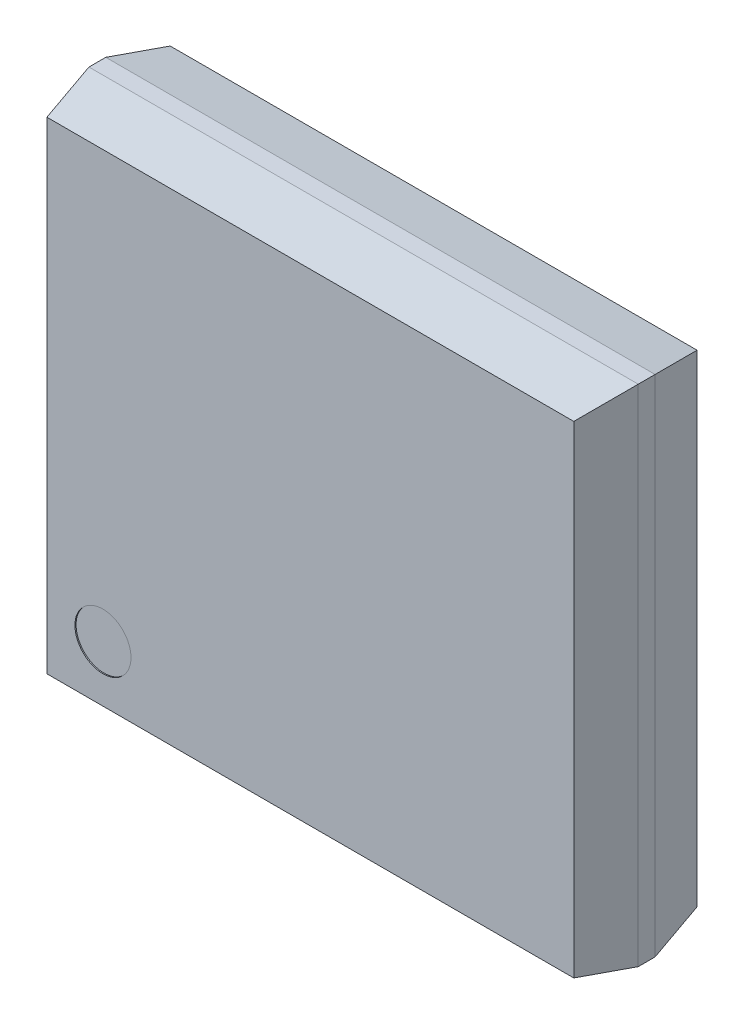
ISO-10303-21;
HEADER;
FILE_DESCRIPTION(('STEP AP214'),'2;1');
FILE_NAME('part.step','',(''),(''),'','','');
FILE_SCHEMA(('AUTOMOTIVE_DESIGN { 1 0 10303 214 1 1 1 1 }'));
ENDSEC;
DATA;
#1=APPLICATION_CONTEXT('core data for automotive mechanical design processes');
#2=APPLICATION_PROTOCOL_DEFINITION('international standard','automotive_design',2000,#1);
#3=PRODUCT_CONTEXT('',#1,'mechanical');
#4=PRODUCT('Part','Part','',(#3));
#5=PRODUCT_RELATED_PRODUCT_CATEGORY('part','',(#4));
#6=PRODUCT_DEFINITION_FORMATION('','',#4);
#7=PRODUCT_DEFINITION_CONTEXT('part definition',#1,'design');
#8=PRODUCT_DEFINITION('design','',#6,#7);
#9=PRODUCT_DEFINITION_SHAPE('','',#8);
#10=(LENGTH_UNIT() NAMED_UNIT(*) SI_UNIT(.MILLI.,.METRE.));
#11=(NAMED_UNIT(*) PLANE_ANGLE_UNIT() SI_UNIT($,.RADIAN.));
#12=(NAMED_UNIT(*) SI_UNIT($,.STERADIAN.) SOLID_ANGLE_UNIT());
#13=UNCERTAINTY_MEASURE_WITH_UNIT(LENGTH_MEASURE(1.E-05),#10,'distance_accuracy_value','');
#14=(GEOMETRIC_REPRESENTATION_CONTEXT(3) GLOBAL_UNCERTAINTY_ASSIGNED_CONTEXT((#13)) GLOBAL_UNIT_ASSIGNED_CONTEXT((#10,
#11,#12)) REPRESENTATION_CONTEXT('',''));
#15=CARTESIAN_POINT('',(0.,0.,0.));
#16=DIRECTION('',(0.,0.,1.));
#17=DIRECTION('',(1.,0.,0.));
#18=AXIS2_PLACEMENT_3D('',#15,#16,#17);
#19=CARTESIAN_POINT('',(-2.45,-2.25,0.55));
#20=DIRECTION('',(1.,0.,0.));
#21=DIRECTION('',(0.,0.,-1.));
#22=AXIS2_PLACEMENT_3D('',#19,#20,#21);
#23=PLANE('',#22);
#24=DIRECTION('',(0.,-1.,0.));
#25=VECTOR('',#24,1.);
#26=CARTESIAN_POINT('',(-2.45,2.25,-0.075));
#27=LINE('',#26,#25);
#28=CARTESIAN_POINT('',(-2.45,2.25,-0.0750000000000001));
#29=VERTEX_POINT('',#28);
#30=CARTESIAN_POINT('',(-2.45,-2.25,-0.075));
#31=VERTEX_POINT('',#30);
#32=EDGE_CURVE('E64',#29,#31,#27,.T.);
#33=ORIENTED_EDGE('',*,*,#32,.T.);
#34=DIRECTION('',(0.,0.,-1.));
#35=VECTOR('',#34,1.);
#36=CARTESIAN_POINT('',(-2.45,-2.25,0.55));
#37=LINE('',#36,#35);
#38=CARTESIAN_POINT('',(-2.45,-2.25,0.075));
#39=VERTEX_POINT('',#38);
#40=EDGE_CURVE('E141',#39,#31,#37,.T.);
#41=ORIENTED_EDGE('',*,*,#40,.F.);
#42=DIRECTION('',(0.,-1.,0.));
#43=VECTOR('',#42,1.);
#44=CARTESIAN_POINT('',(-2.45,2.25,0.075));
#45=LINE('',#44,#43);
#46=CARTESIAN_POINT('',(-2.45,2.25,0.075));
#47=VERTEX_POINT('',#46);
#48=EDGE_CURVE('E198',#47,#39,#45,.T.);
#49=ORIENTED_EDGE('',*,*,#48,.F.);
#50=DIRECTION('',(0.,0.,-1.));
#51=VECTOR('',#50,1.);
#52=CARTESIAN_POINT('',(-2.45,2.25,0.55));
#53=LINE('',#52,#51);
#54=EDGE_CURVE('E153',#47,#29,#53,.T.);
#55=ORIENTED_EDGE('',*,*,#54,.T.);
#56=EDGE_LOOP('',(#33,#41,#49,#55));
#57=FACE_BOUND('',#56,.T.);
#58=ADVANCED_FACE('F41',(#57),#23,.F.);
#59=CARTESIAN_POINT('',(0.,0.,-0.55));
#60=DIRECTION('',(0.,0.,-1.));
#61=DIRECTION('',(-1.,0.,0.));
#62=AXIS2_PLACEMENT_3D('',#59,#60,#61);
#63=PLANE('',#62);
#64=DIRECTION('',(0.,-1.,0.));
#65=VECTOR('',#64,1.);
#66=CARTESIAN_POINT('',(2.35,2.25,-0.55));
#67=LINE('',#66,#65);
#68=CARTESIAN_POINT('',(2.35,2.15,-0.55));
#69=VERTEX_POINT('',#68);
#70=CARTESIAN_POINT('',(2.35,-2.15,-0.55));
#71=VERTEX_POINT('',#70);
#72=EDGE_CURVE('E120',#69,#71,#67,.T.);
#73=ORIENTED_EDGE('',*,*,#72,.T.);
#74=DIRECTION('',(-1.,0.,0.));
#75=VECTOR('',#74,1.);
#76=CARTESIAN_POINT('',(2.45,-2.15,-0.55));
#77=LINE('',#76,#75);
#78=CARTESIAN_POINT('',(-2.35,-2.15,-0.55));
#79=VERTEX_POINT('',#78);
#80=EDGE_CURVE('E131',#71,#79,#77,.T.);
#81=ORIENTED_EDGE('',*,*,#80,.T.);
#82=DIRECTION('',(0.,-1.,0.));
#83=VECTOR('',#82,1.);
#84=CARTESIAN_POINT('',(-2.35,2.25,-0.55));
#85=LINE('',#84,#83);
#86=CARTESIAN_POINT('',(-2.35,2.15,-0.55));
#87=VERTEX_POINT('',#86);
#88=EDGE_CURVE('E133',#87,#79,#85,.T.);
#89=ORIENTED_EDGE('',*,*,#88,.F.);
#90=DIRECTION('',(-1.,0.,0.));
#91=VECTOR('',#90,1.);
#92=CARTESIAN_POINT('',(2.45,2.15,-0.55));
#93=LINE('',#92,#91);
#94=EDGE_CURVE('E188',#69,#87,#93,.T.);
#95=ORIENTED_EDGE('',*,*,#94,.F.);
#96=EDGE_LOOP('',(#73,#81,#89,#95));
#97=FACE_BOUND('',#96,.T.);
#98=ADVANCED_FACE('F262',(#97),#63,.T.);
#99=CARTESIAN_POINT('',(2.45,-2.15,-0.55));
#100=DIRECTION('',(0.,-0.978549784986749,-0.206010481049842));
#101=DIRECTION('',(0.,0.206010481049842,-0.978549784986749));
#102=AXIS2_PLACEMENT_3D('',#99,#100,#101);
#103=PLANE('',#102);
#104=DIRECTION('',(-0.201773308922127,0.201773308922127,-0.958423217380105));
#105=VECTOR('',#104,1.);
#106=CARTESIAN_POINT('',(2.35407124681934,-2.15407124681934,-0.530661577608143));
#107=LINE('',#106,#105);
#108=CARTESIAN_POINT('',(2.45,-2.25,-0.075));
#109=VERTEX_POINT('',#108);
#110=EDGE_CURVE('E111',#109,#71,#107,.T.);
#111=ORIENTED_EDGE('',*,*,#110,.F.);
#112=DIRECTION('',(-1.,0.,0.));
#113=VECTOR('',#112,1.);
#114=CARTESIAN_POINT('',(2.45,-2.25,-0.075));
#115=LINE('',#114,#113);
#116=EDGE_CURVE('E129',#109,#31,#115,.T.);
#117=ORIENTED_EDGE('',*,*,#116,.T.);
#118=DIRECTION('',(0.201773308922127,0.201773308922127,-0.958423217380105));
#119=VECTOR('',#118,1.);
#120=CARTESIAN_POINT('',(-2.15458015267176,-1.95458015267176,-1.47824427480916));
#121=LINE('',#120,#119);
#122=EDGE_CURVE('E209',#31,#79,#121,.T.);
#123=ORIENTED_EDGE('',*,*,#122,.T.);
#124=ORIENTED_EDGE('',*,*,#80,.F.);
#125=EDGE_LOOP('',(#111,#117,#123,#124));
#126=FACE_BOUND('',#125,.T.);
#127=ADVANCED_FACE('F127',(#126),#103,.T.);
#128=CARTESIAN_POINT('',(2.45,2.15,-0.55));
#129=DIRECTION('',(0.,-0.978549784986749,0.206010481049842));
#130=DIRECTION('',(0.,-0.206010481049842,-0.978549784986749));
#131=AXIS2_PLACEMENT_3D('',#128,#129,#130);
#132=PLANE('',#131);
#133=DIRECTION('',(-1.,0.,0.));
#134=VECTOR('',#133,1.);
#135=CARTESIAN_POINT('',(2.45,2.25,-0.075));
#136=LINE('',#135,#134);
#137=CARTESIAN_POINT('',(2.45,2.25,-0.075));
#138=VERTEX_POINT('',#137);
#139=EDGE_CURVE('E143',#138,#29,#136,.T.);
#140=ORIENTED_EDGE('',*,*,#139,.F.);
#141=DIRECTION('',(-0.201773308922127,-0.201773308922127,-0.958423217380105));
#142=VECTOR('',#141,1.);
#143=CARTESIAN_POINT('',(2.35407124681934,2.15407124681934,-0.530661577608143));
#144=LINE('',#143,#142);
#145=EDGE_CURVE('E114',#138,#69,#144,.T.);
#146=ORIENTED_EDGE('',*,*,#145,.T.);
#147=ORIENTED_EDGE('',*,*,#94,.T.);
#148=DIRECTION('',(0.201773308922127,-0.201773308922127,-0.958423217380105));
#149=VECTOR('',#148,1.);
#150=CARTESIAN_POINT('',(-2.15458015267176,1.95458015267176,-1.47824427480916));
#151=LINE('',#150,#149);
#152=EDGE_CURVE('E11',#29,#87,#151,.T.);
#153=ORIENTED_EDGE('',*,*,#152,.F.);
#154=EDGE_LOOP('',(#140,#146,#147,#153));
#155=FACE_BOUND('',#154,.T.);
#156=ADVANCED_FACE('F277',(#155),#132,.F.);
#157=CARTESIAN_POINT('',(2.45,-2.25,0.55));
#158=DIRECTION('',(-1.,0.,0.));
#159=DIRECTION('',(0.,0.,1.));
#160=AXIS2_PLACEMENT_3D('',#157,#158,#159);
#161=PLANE('',#160);
#162=DIRECTION('',(0.,0.,-1.));
#163=VECTOR('',#162,1.);
#164=CARTESIAN_POINT('',(2.45,-2.25,0.55));
#165=LINE('',#164,#163);
#166=CARTESIAN_POINT('',(2.45,-2.25,0.075));
#167=VERTEX_POINT('',#166);
#168=EDGE_CURVE('E139',#167,#109,#165,.T.);
#169=ORIENTED_EDGE('',*,*,#168,.T.);
#170=DIRECTION('',(0.,-1.,0.));
#171=VECTOR('',#170,1.);
#172=CARTESIAN_POINT('',(2.45,2.25,-0.075));
#173=LINE('',#172,#171);
#174=EDGE_CURVE('E108',#138,#109,#173,.T.);
#175=ORIENTED_EDGE('',*,*,#174,.F.);
#176=DIRECTION('',(0.,0.,-1.));
#177=VECTOR('',#176,1.);
#178=CARTESIAN_POINT('',(2.45,2.25,0.55));
#179=LINE('',#178,#177);
#180=CARTESIAN_POINT('',(2.45,2.25,0.075));
#181=VERTEX_POINT('',#180);
#182=EDGE_CURVE('E162',#181,#138,#179,.T.);
#183=ORIENTED_EDGE('',*,*,#182,.F.);
#184=DIRECTION('',(0.,-1.,0.));
#185=VECTOR('',#184,1.);
#186=CARTESIAN_POINT('',(2.45,2.25,0.075));
#187=LINE('',#186,#185);
#188=EDGE_CURVE('E146',#181,#167,#187,.T.);
#189=ORIENTED_EDGE('',*,*,#188,.T.);
#190=EDGE_LOOP('',(#169,#175,#183,#189));
#191=FACE_BOUND('',#190,.T.);
#192=ADVANCED_FACE('F43',(#191),#161,.F.);
#193=CARTESIAN_POINT('',(0.,0.,0.55));
#194=DIRECTION('',(0.,0.,-1.));
#195=DIRECTION('',(-1.,0.,0.));
#196=AXIS2_PLACEMENT_3D('',#193,#194,#195);
#197=PLANE('',#196);
#198=CARTESIAN_POINT('',(-1.85,-1.65,0.55));
#199=DIRECTION('',(0.,0.,1.));
#200=DIRECTION('',(1.,0.,0.));
#201=AXIS2_PLACEMENT_3D('',#198,#199,#200);
#202=CIRCLE('',#201,0.25);
#203=CARTESIAN_POINT('',(-1.6,-1.65,0.55));
#204=VERTEX_POINT('',#203);
#205=EDGE_CURVE('E223',#204,#204,#202,.T.);
#206=ORIENTED_EDGE('',*,*,#205,.F.);
#207=EDGE_LOOP('',(#206));
#208=FACE_BOUND('',#207,.T.);
#209=DIRECTION('',(0.,-1.,0.));
#210=VECTOR('',#209,1.);
#211=CARTESIAN_POINT('',(2.35,2.25,0.55));
#212=LINE('',#211,#210);
#213=CARTESIAN_POINT('',(2.35,2.15,0.55));
#214=VERTEX_POINT('',#213);
#215=CARTESIAN_POINT('',(2.35,-2.15,0.55));
#216=VERTEX_POINT('',#215);
#217=EDGE_CURVE('E206',#214,#216,#212,.T.);
#218=ORIENTED_EDGE('',*,*,#217,.F.);
#219=DIRECTION('',(-1.,0.,0.));
#220=VECTOR('',#219,1.);
#221=CARTESIAN_POINT('',(2.45,2.15,0.55));
#222=LINE('',#221,#220);
#223=CARTESIAN_POINT('',(-2.35,2.15,0.55));
#224=VERTEX_POINT('',#223);
#225=EDGE_CURVE('E57',#214,#224,#222,.T.);
#226=ORIENTED_EDGE('',*,*,#225,.T.);
#227=DIRECTION('',(0.,-1.,0.));
#228=VECTOR('',#227,1.);
#229=CARTESIAN_POINT('',(-2.35,2.25,0.55));
#230=LINE('',#229,#228);
#231=CARTESIAN_POINT('',(-2.35,-2.15,0.55));
#232=VERTEX_POINT('',#231);
#233=EDGE_CURVE('E197',#224,#232,#230,.T.);
#234=ORIENTED_EDGE('',*,*,#233,.T.);
#235=DIRECTION('',(-1.,0.,0.));
#236=VECTOR('',#235,1.);
#237=CARTESIAN_POINT('',(2.45,-2.15,0.55));
#238=LINE('',#237,#236);
#239=EDGE_CURVE('E155',#216,#232,#238,.T.);
#240=ORIENTED_EDGE('',*,*,#239,.F.);
#241=EDGE_LOOP('',(#218,#226,#234,#240));
#242=FACE_BOUND('',#241,.T.);
#243=ADVANCED_FACE('F239',(#208,#242),#197,.F.);
#244=CARTESIAN_POINT('',(2.45,-2.15,0.55));
#245=DIRECTION('',(0.,0.978549784986749,-0.206010481049842));
#246=DIRECTION('',(0.,0.206010481049842,0.978549784986749));
#247=AXIS2_PLACEMENT_3D('',#244,#245,#246);
#248=PLANE('',#247);
#249=DIRECTION('',(0.201773308922127,-0.201773308922127,-0.958423217380105));
#250=VECTOR('',#249,1.);
#251=CARTESIAN_POINT('',(2.35407124681934,-2.15407124681934,0.530661577608143));
#252=LINE('',#251,#250);
#253=EDGE_CURVE('E201',#216,#167,#252,.T.);
#254=ORIENTED_EDGE('',*,*,#253,.F.);
#255=ORIENTED_EDGE('',*,*,#239,.T.);
#256=DIRECTION('',(-0.201773308922127,-0.201773308922127,-0.958423217380105));
#257=VECTOR('',#256,1.);
#258=CARTESIAN_POINT('',(-2.15458015267176,-1.95458015267176,1.47824427480916));
#259=LINE('',#258,#257);
#260=EDGE_CURVE('E191',#232,#39,#259,.T.);
#261=ORIENTED_EDGE('',*,*,#260,.T.);
#262=DIRECTION('',(-1.,0.,0.));
#263=VECTOR('',#262,1.);
#264=CARTESIAN_POINT('',(2.45,-2.25,0.075));
#265=LINE('',#264,#263);
#266=EDGE_CURVE('E149',#167,#39,#265,.T.);
#267=ORIENTED_EDGE('',*,*,#266,.F.);
#268=EDGE_LOOP('',(#254,#255,#261,#267));
#269=FACE_BOUND('',#268,.T.);
#270=ADVANCED_FACE('F241',(#269),#248,.F.);
#271=CARTESIAN_POINT('',(2.45,2.15,0.55));
#272=DIRECTION('',(0.,0.978549784986749,0.206010481049842));
#273=DIRECTION('',(0.,-0.206010481049842,0.978549784986749));
#274=AXIS2_PLACEMENT_3D('',#271,#272,#273);
#275=PLANE('',#274);
#276=ORIENTED_EDGE('',*,*,#225,.F.);
#277=DIRECTION('',(0.201773308922127,0.201773308922127,-0.958423217380105));
#278=VECTOR('',#277,1.);
#279=CARTESIAN_POINT('',(2.35407124681934,2.15407124681934,0.530661577608143));
#280=LINE('',#279,#278);
#281=EDGE_CURVE('E50',#214,#181,#280,.T.);
#282=ORIENTED_EDGE('',*,*,#281,.T.);
#283=DIRECTION('',(-1.,0.,0.));
#284=VECTOR('',#283,1.);
#285=CARTESIAN_POINT('',(2.45,2.25,0.075));
#286=LINE('',#285,#284);
#287=EDGE_CURVE('E175',#181,#47,#286,.T.);
#288=ORIENTED_EDGE('',*,*,#287,.T.);
#289=DIRECTION('',(-0.201773308922127,0.201773308922127,-0.958423217380105));
#290=VECTOR('',#289,1.);
#291=CARTESIAN_POINT('',(-2.15458015267176,1.95458015267176,1.47824427480916));
#292=LINE('',#291,#290);
#293=EDGE_CURVE('E166',#224,#47,#292,.T.);
#294=ORIENTED_EDGE('',*,*,#293,.F.);
#295=EDGE_LOOP('',(#276,#282,#288,#294));
#296=FACE_BOUND('',#295,.T.);
#297=ADVANCED_FACE('F173',(#296),#275,.T.);
#298=CARTESIAN_POINT('',(-2.45,-2.25,0.55));
#299=DIRECTION('',(0.,1.,0.));
#300=DIRECTION('',(0.,0.,1.));
#301=AXIS2_PLACEMENT_3D('',#298,#299,#300);
#302=PLANE('',#301);
#303=ORIENTED_EDGE('',*,*,#116,.F.);
#304=ORIENTED_EDGE('',*,*,#168,.F.);
#305=ORIENTED_EDGE('',*,*,#266,.T.);
#306=ORIENTED_EDGE('',*,*,#40,.T.);
#307=EDGE_LOOP('',(#303,#304,#305,#306));
#308=FACE_BOUND('',#307,.T.);
#309=ADVANCED_FACE('F137',(#308),#302,.F.);
#310=CARTESIAN_POINT('',(-2.45,2.25,0.55));
#311=DIRECTION('',(0.,-1.,0.));
#312=DIRECTION('',(0.,0.,-1.));
#313=AXIS2_PLACEMENT_3D('',#310,#311,#312);
#314=PLANE('',#313);
#315=ORIENTED_EDGE('',*,*,#182,.T.);
#316=ORIENTED_EDGE('',*,*,#139,.T.);
#317=ORIENTED_EDGE('',*,*,#54,.F.);
#318=ORIENTED_EDGE('',*,*,#287,.F.);
#319=EDGE_LOOP('',(#315,#316,#317,#318));
#320=FACE_BOUND('',#319,.T.);
#321=ADVANCED_FACE('F179',(#320),#314,.F.);
#322=CARTESIAN_POINT('',(-2.35,2.25,0.55));
#323=DIRECTION('',(0.978549784986749,0.,-0.206010481049842));
#324=DIRECTION('',(-0.206010481049842,0.,-0.978549784986749));
#325=AXIS2_PLACEMENT_3D('',#322,#323,#324);
#326=PLANE('',#325);
#327=ORIENTED_EDGE('',*,*,#233,.F.);
#328=ORIENTED_EDGE('',*,*,#293,.T.);
#329=ORIENTED_EDGE('',*,*,#48,.T.);
#330=ORIENTED_EDGE('',*,*,#260,.F.);
#331=EDGE_LOOP('',(#327,#328,#329,#330));
#332=FACE_BOUND('',#331,.T.);
#333=ADVANCED_FACE('F251',(#332),#326,.F.);
#334=CARTESIAN_POINT('',(2.35,2.25,0.55));
#335=DIRECTION('',(0.978549784986749,0.,0.206010481049842));
#336=DIRECTION('',(0.206010481049842,0.,-0.978549784986749));
#337=AXIS2_PLACEMENT_3D('',#334,#335,#336);
#338=PLANE('',#337);
#339=ORIENTED_EDGE('',*,*,#253,.T.);
#340=ORIENTED_EDGE('',*,*,#188,.F.);
#341=ORIENTED_EDGE('',*,*,#281,.F.);
#342=ORIENTED_EDGE('',*,*,#217,.T.);
#343=EDGE_LOOP('',(#339,#340,#341,#342));
#344=FACE_BOUND('',#343,.T.);
#345=ADVANCED_FACE('F245',(#344),#338,.T.);
#346=CARTESIAN_POINT('',(-2.35,2.25,-0.55));
#347=DIRECTION('',(-0.978549784986749,0.,-0.206010481049842));
#348=DIRECTION('',(-0.206010481049842,0.,0.978549784986749));
#349=AXIS2_PLACEMENT_3D('',#346,#347,#348);
#350=PLANE('',#349);
#351=ORIENTED_EDGE('',*,*,#32,.F.);
#352=ORIENTED_EDGE('',*,*,#152,.T.);
#353=ORIENTED_EDGE('',*,*,#88,.T.);
#354=ORIENTED_EDGE('',*,*,#122,.F.);
#355=EDGE_LOOP('',(#351,#352,#353,#354));
#356=FACE_BOUND('',#355,.T.);
#357=ADVANCED_FACE('F258',(#356),#350,.T.);
#358=CARTESIAN_POINT('',(2.35,2.25,-0.55));
#359=DIRECTION('',(-0.978549784986749,0.,0.206010481049842));
#360=DIRECTION('',(0.206010481049842,0.,0.978549784986749));
#361=AXIS2_PLACEMENT_3D('',#358,#359,#360);
#362=PLANE('',#361);
#363=ORIENTED_EDGE('',*,*,#110,.T.);
#364=ORIENTED_EDGE('',*,*,#72,.F.);
#365=ORIENTED_EDGE('',*,*,#145,.F.);
#366=ORIENTED_EDGE('',*,*,#174,.T.);
#367=EDGE_LOOP('',(#363,#364,#365,#366));
#368=FACE_BOUND('',#367,.T.);
#369=ADVANCED_FACE('F110',(#368),#362,.F.);
#370=CARTESIAN_POINT('',(-1.85,-1.65,0.54));
#371=DIRECTION('',(0.,0.,1.));
#372=DIRECTION('',(1.,0.,0.));
#373=AXIS2_PLACEMENT_3D('',#370,#371,#372);
#374=CYLINDRICAL_SURFACE('',#373,0.25);
#375=CARTESIAN_POINT('',(-1.85,-1.65,0.54));
#376=DIRECTION('',(0.,0.,1.));
#377=DIRECTION('',(1.,0.,0.));
#378=AXIS2_PLACEMENT_3D('',#375,#376,#377);
#379=CIRCLE('',#378,0.25);
#380=CARTESIAN_POINT('',(-1.6,-1.65,0.54));
#381=VERTEX_POINT('',#380);
#382=EDGE_CURVE('E121',#381,#381,#379,.T.);
#383=ORIENTED_EDGE('',*,*,#382,.F.);
#384=EDGE_LOOP('',(#383));
#385=FACE_BOUND('',#384,.T.);
#386=ORIENTED_EDGE('',*,*,#205,.T.);
#387=EDGE_LOOP('',(#386));
#388=FACE_BOUND('',#387,.T.);
#389=ADVANCED_FACE('F233',(#385,#388),#374,.F.);
#390=CARTESIAN_POINT('',(-1.85,-1.65,0.54));
#391=DIRECTION('',(0.,0.,1.));
#392=DIRECTION('',(1.,0.,0.));
#393=AXIS2_PLACEMENT_3D('',#390,#391,#392);
#394=PLANE('',#393);
#395=ORIENTED_EDGE('',*,*,#382,.T.);
#396=EDGE_LOOP('',(#395));
#397=FACE_BOUND('',#396,.T.);
#398=ADVANCED_FACE('F231',(#397),#394,.T.);
#399=CLOSED_SHELL('',(#58,#98,#127,#156,#192,#243,#270,#297,#309,#321,#333,#345,#357,#369,#389,#398));
#400=MANIFOLD_SOLID_BREP('B2',#399);
#401=ADVANCED_BREP_SHAPE_REPRESENTATION('',(#18,#400),#14);
#402=SHAPE_DEFINITION_REPRESENTATION(#9,#401);
ENDSEC;
END-ISO-10303-21;
